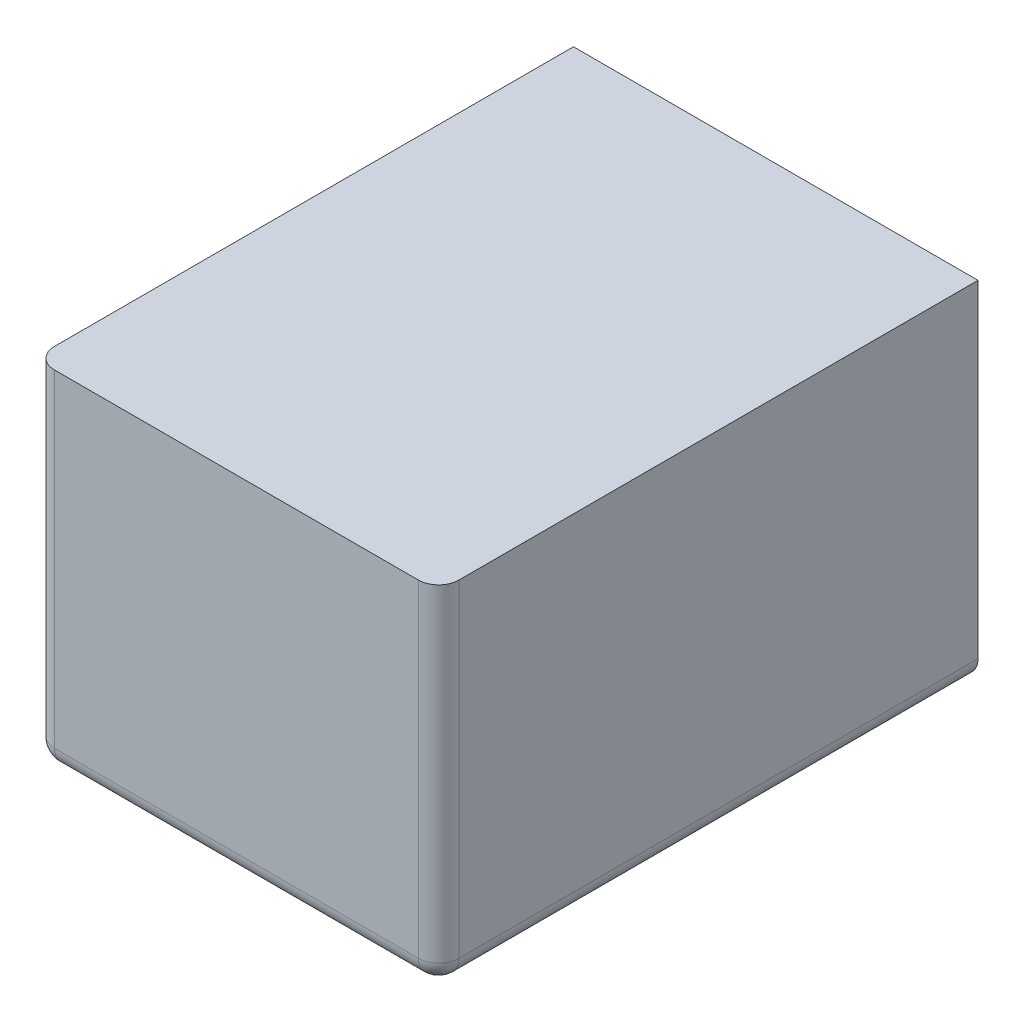
ISO-10303-21;
HEADER;
FILE_DESCRIPTION(('STEP AP214'),'2;1');
FILE_NAME('part.step','',(''),(''),'','','');
FILE_SCHEMA(('AUTOMOTIVE_DESIGN { 1 0 10303 214 1 1 1 1 }'));
ENDSEC;
DATA;
#1=APPLICATION_CONTEXT('core data for automotive mechanical design processes');
#2=APPLICATION_PROTOCOL_DEFINITION('international standard','automotive_design',2000,#1);
#3=PRODUCT_CONTEXT('',#1,'mechanical');
#4=PRODUCT('Part','Part','',(#3));
#5=PRODUCT_RELATED_PRODUCT_CATEGORY('part','',(#4));
#6=PRODUCT_DEFINITION_FORMATION('','',#4);
#7=PRODUCT_DEFINITION_CONTEXT('part definition',#1,'design');
#8=PRODUCT_DEFINITION('design','',#6,#7);
#9=PRODUCT_DEFINITION_SHAPE('','',#8);
#10=(LENGTH_UNIT() NAMED_UNIT(*) SI_UNIT(.MILLI.,.METRE.));
#11=(NAMED_UNIT(*) PLANE_ANGLE_UNIT() SI_UNIT($,.RADIAN.));
#12=(NAMED_UNIT(*) SI_UNIT($,.STERADIAN.) SOLID_ANGLE_UNIT());
#13=UNCERTAINTY_MEASURE_WITH_UNIT(LENGTH_MEASURE(1.E-05),#10,'distance_accuracy_value','');
#14=(GEOMETRIC_REPRESENTATION_CONTEXT(3) GLOBAL_UNCERTAINTY_ASSIGNED_CONTEXT((#13)) GLOBAL_UNIT_ASSIGNED_CONTEXT((#10,
#11,#12)) REPRESENTATION_CONTEXT('',''));
#15=CARTESIAN_POINT('',(0.,0.,0.));
#16=DIRECTION('',(0.,0.,1.));
#17=DIRECTION('',(1.,0.,0.));
#18=AXIS2_PLACEMENT_3D('',#15,#16,#17);
#19=CARTESIAN_POINT('',(380.,1000.,320.));
#20=DIRECTION('',(0.,0.,-1.));
#21=DIRECTION('',(-1.,0.,0.));
#22=AXIS2_PLACEMENT_3D('',#19,#20,#21);
#23=PLANE('',#22);
#24=DIRECTION('',(-1.,0.,0.));
#25=VECTOR('',#24,1.);
#26=CARTESIAN_POINT('',(590.,980.,320.));
#27=LINE('',#26,#25);
#28=CARTESIAN_POINT('',(800.,980.,320.));
#29=VERTEX_POINT('',#28);
#30=CARTESIAN_POINT('',(380.,980.,320.));
#31=VERTEX_POINT('',#30);
#32=EDGE_CURVE('P0_E10',#29,#31,#27,.T.);
#33=ORIENTED_EDGE('',*,*,#32,.F.);
#34=DIRECTION('',(0.,-1.,0.));
#35=VECTOR('',#34,1.);
#36=CARTESIAN_POINT('',(800.,990.,320.));
#37=LINE('',#36,#35);
#38=CARTESIAN_POINT('',(800.,1000.,320.));
#39=VERTEX_POINT('',#38);
#40=EDGE_CURVE('P0_E27',#39,#29,#37,.T.);
#41=ORIENTED_EDGE('',*,*,#40,.F.);
#42=DIRECTION('',(-1.,0.,0.));
#43=VECTOR('',#42,1.);
#44=CARTESIAN_POINT('',(590.,1000.,320.));
#45=LINE('',#44,#43);
#46=CARTESIAN_POINT('',(380.,1000.,320.));
#47=VERTEX_POINT('',#46);
#48=EDGE_CURVE('P0_E76',#39,#47,#45,.T.);
#49=ORIENTED_EDGE('',*,*,#48,.T.);
#50=DIRECTION('',(0.,-1.,0.));
#51=VECTOR('',#50,1.);
#52=CARTESIAN_POINT('',(380.,990.,320.));
#53=LINE('',#52,#51);
#54=EDGE_CURVE('P0_E36',#47,#31,#53,.T.);
#55=ORIENTED_EDGE('',*,*,#54,.T.);
#56=EDGE_LOOP('',(#33,#41,#49,#55));
#57=FACE_BOUND('',#56,.T.);
#58=ADVANCED_FACE('P0_F16',(#57),#23,.F.);
#59=CARTESIAN_POINT('',(380.,1000.,720.));
#60=DIRECTION('',(1.,0.,0.));
#61=DIRECTION('',(0.,0.,-1.));
#62=AXIS2_PLACEMENT_3D('',#59,#60,#61);
#63=PLANE('',#62);
#64=DIRECTION('',(0.,0.,-1.));
#65=VECTOR('',#64,1.);
#66=CARTESIAN_POINT('',(380.,980.,280.));
#67=LINE('',#66,#65);
#68=CARTESIAN_POINT('',(380.,980.,240.));
#69=VERTEX_POINT('',#68);
#70=EDGE_CURVE('P0_E93',#31,#69,#67,.T.);
#71=ORIENTED_EDGE('',*,*,#70,.F.);
#72=ORIENTED_EDGE('',*,*,#54,.F.);
#73=DIRECTION('',(0.,0.,-1.));
#74=VECTOR('',#73,1.);
#75=CARTESIAN_POINT('',(380.,1000.,280.));
#76=LINE('',#75,#74);
#77=CARTESIAN_POINT('',(380.,1000.,240.));
#78=VERTEX_POINT('',#77);
#79=EDGE_CURVE('P0_E66',#47,#78,#76,.T.);
#80=ORIENTED_EDGE('',*,*,#79,.T.);
#81=DIRECTION('',(0.,-1.,0.));
#82=VECTOR('',#81,1.);
#83=CARTESIAN_POINT('',(380.,990.,240.));
#84=LINE('',#83,#82);
#85=EDGE_CURVE('P0_E61',#78,#69,#84,.T.);
#86=ORIENTED_EDGE('',*,*,#85,.T.);
#87=EDGE_LOOP('',(#71,#72,#80,#86));
#88=FACE_BOUND('',#87,.T.);
#89=ADVANCED_FACE('P0_F104',(#88),#63,.F.);
#90=CARTESIAN_POINT('',(800.,1000.,240.));
#91=DIRECTION('',(0.,0.,1.));
#92=DIRECTION('',(1.,0.,0.));
#93=AXIS2_PLACEMENT_3D('',#90,#91,#92);
#94=PLANE('',#93);
#95=DIRECTION('',(1.,0.,0.));
#96=VECTOR('',#95,1.);
#97=CARTESIAN_POINT('',(590.,980.,240.));
#98=LINE('',#97,#96);
#99=CARTESIAN_POINT('',(800.,980.,240.));
#100=VERTEX_POINT('',#99);
#101=EDGE_CURVE('P0_E86',#69,#100,#98,.T.);
#102=ORIENTED_EDGE('',*,*,#101,.F.);
#103=ORIENTED_EDGE('',*,*,#85,.F.);
#104=DIRECTION('',(1.,0.,0.));
#105=VECTOR('',#104,1.);
#106=CARTESIAN_POINT('',(590.,1000.,240.));
#107=LINE('',#106,#105);
#108=CARTESIAN_POINT('',(800.,1000.,240.));
#109=VERTEX_POINT('',#108);
#110=EDGE_CURVE('P0_E59',#78,#109,#107,.T.);
#111=ORIENTED_EDGE('',*,*,#110,.T.);
#112=DIRECTION('',(0.,-1.,0.));
#113=VECTOR('',#112,1.);
#114=CARTESIAN_POINT('',(800.,990.,240.));
#115=LINE('',#114,#113);
#116=EDGE_CURVE('P0_E55',#109,#100,#115,.T.);
#117=ORIENTED_EDGE('',*,*,#116,.T.);
#118=EDGE_LOOP('',(#102,#103,#111,#117));
#119=FACE_BOUND('',#118,.T.);
#120=ADVANCED_FACE('P0_F60',(#119),#94,.F.);
#121=CARTESIAN_POINT('',(800.,1000.,800.));
#122=DIRECTION('',(-1.,0.,0.));
#123=DIRECTION('',(0.,0.,1.));
#124=AXIS2_PLACEMENT_3D('',#121,#122,#123);
#125=PLANE('',#124);
#126=DIRECTION('',(0.,0.,1.));
#127=VECTOR('',#126,1.);
#128=CARTESIAN_POINT('',(800.,980.,280.));
#129=LINE('',#128,#127);
#130=EDGE_CURVE('P0_E74',#100,#29,#129,.T.);
#131=ORIENTED_EDGE('',*,*,#130,.F.);
#132=ORIENTED_EDGE('',*,*,#116,.F.);
#133=DIRECTION('',(0.,0.,1.));
#134=VECTOR('',#133,1.);
#135=CARTESIAN_POINT('',(800.,1000.,280.));
#136=LINE('',#135,#134);
#137=EDGE_CURVE('P0_E20',#109,#39,#136,.T.);
#138=ORIENTED_EDGE('',*,*,#137,.T.);
#139=ORIENTED_EDGE('',*,*,#40,.T.);
#140=EDGE_LOOP('',(#131,#132,#138,#139));
#141=FACE_BOUND('',#140,.T.);
#142=ADVANCED_FACE('P0_F71',(#141),#125,.F.);
#143=CARTESIAN_POINT('',(0.,1000.,0.));
#144=DIRECTION('',(0.,-1.,0.));
#145=DIRECTION('',(0.,0.,-1.));
#146=AXIS2_PLACEMENT_3D('',#143,#144,#145);
#147=PLANE('',#146);
#148=ORIENTED_EDGE('',*,*,#48,.F.);
#149=ORIENTED_EDGE('',*,*,#137,.F.);
#150=ORIENTED_EDGE('',*,*,#110,.F.);
#151=ORIENTED_EDGE('',*,*,#79,.F.);
#152=EDGE_LOOP('',(#148,#149,#150,#151));
#153=FACE_BOUND('',#152,.T.);
#154=ADVANCED_FACE('P0_F78',(#153),#147,.F.);
#155=CARTESIAN_POINT('',(0.,980.,0.));
#156=DIRECTION('',(0.,-1.,0.));
#157=DIRECTION('',(0.,0.,-1.));
#158=AXIS2_PLACEMENT_3D('',#155,#156,#157);
#159=PLANE('',#158);
#160=ORIENTED_EDGE('',*,*,#130,.T.);
#161=ORIENTED_EDGE('',*,*,#32,.T.);
#162=ORIENTED_EDGE('',*,*,#70,.T.);
#163=ORIENTED_EDGE('',*,*,#101,.T.);
#164=EDGE_LOOP('',(#160,#161,#162,#163));
#165=FACE_BOUND('',#164,.T.);
#166=ADVANCED_FACE('P0_F18',(#165),#159,.T.);
#167=CLOSED_SHELL('',(#58,#89,#120,#142,#154,#166));
#168=MANIFOLD_SOLID_BREP('P0_B1',#167);
#169=CARTESIAN_POINT('',(380.,1000.,480.));
#170=DIRECTION('',(0.,0.,-1.));
#171=DIRECTION('',(-1.,0.,0.));
#172=AXIS2_PLACEMENT_3D('',#169,#170,#171);
#173=PLANE('',#172);
#174=DIRECTION('',(-1.,0.,0.));
#175=VECTOR('',#174,1.);
#176=CARTESIAN_POINT('',(590.,980.,480.));
#177=LINE('',#176,#175);
#178=CARTESIAN_POINT('',(800.,980.,480.));
#179=VERTEX_POINT('',#178);
#180=CARTESIAN_POINT('',(380.,980.,480.));
#181=VERTEX_POINT('',#180);
#182=EDGE_CURVE('P1_E11',#179,#181,#177,.T.);
#183=ORIENTED_EDGE('',*,*,#182,.F.);
#184=DIRECTION('',(0.,-1.,0.));
#185=VECTOR('',#184,1.);
#186=CARTESIAN_POINT('',(800.,990.,480.));
#187=LINE('',#186,#185);
#188=CARTESIAN_POINT('',(800.,1000.,480.));
#189=VERTEX_POINT('',#188);
#190=EDGE_CURVE('P1_E28',#189,#179,#187,.T.);
#191=ORIENTED_EDGE('',*,*,#190,.F.);
#192=DIRECTION('',(-1.,0.,0.));
#193=VECTOR('',#192,1.);
#194=CARTESIAN_POINT('',(590.,1000.,480.));
#195=LINE('',#194,#193);
#196=CARTESIAN_POINT('',(380.,1000.,480.));
#197=VERTEX_POINT('',#196);
#198=EDGE_CURVE('P1_E77',#189,#197,#195,.T.);
#199=ORIENTED_EDGE('',*,*,#198,.T.);
#200=DIRECTION('',(0.,-1.,0.));
#201=VECTOR('',#200,1.);
#202=CARTESIAN_POINT('',(380.,990.,480.));
#203=LINE('',#202,#201);
#204=EDGE_CURVE('P1_E37',#197,#181,#203,.T.);
#205=ORIENTED_EDGE('',*,*,#204,.T.);
#206=EDGE_LOOP('',(#183,#191,#199,#205));
#207=FACE_BOUND('',#206,.T.);
#208=ADVANCED_FACE('P1_F17',(#207),#173,.F.);
#209=CARTESIAN_POINT('',(380.,1000.,720.));
#210=DIRECTION('',(1.,0.,0.));
#211=DIRECTION('',(0.,0.,-1.));
#212=AXIS2_PLACEMENT_3D('',#209,#210,#211);
#213=PLANE('',#212);
#214=DIRECTION('',(0.,0.,-1.));
#215=VECTOR('',#214,1.);
#216=CARTESIAN_POINT('',(380.,980.,440.));
#217=LINE('',#216,#215);
#218=CARTESIAN_POINT('',(380.,980.,400.));
#219=VERTEX_POINT('',#218);
#220=EDGE_CURVE('P1_E94',#181,#219,#217,.T.);
#221=ORIENTED_EDGE('',*,*,#220,.F.);
#222=ORIENTED_EDGE('',*,*,#204,.F.);
#223=DIRECTION('',(0.,0.,-1.));
#224=VECTOR('',#223,1.);
#225=CARTESIAN_POINT('',(380.,1000.,440.));
#226=LINE('',#225,#224);
#227=CARTESIAN_POINT('',(380.,1000.,400.));
#228=VERTEX_POINT('',#227);
#229=EDGE_CURVE('P1_E67',#197,#228,#226,.T.);
#230=ORIENTED_EDGE('',*,*,#229,.T.);
#231=DIRECTION('',(0.,-1.,0.));
#232=VECTOR('',#231,1.);
#233=CARTESIAN_POINT('',(380.,990.,400.));
#234=LINE('',#233,#232);
#235=EDGE_CURVE('P1_E62',#228,#219,#234,.T.);
#236=ORIENTED_EDGE('',*,*,#235,.T.);
#237=EDGE_LOOP('',(#221,#222,#230,#236));
#238=FACE_BOUND('',#237,.T.);
#239=ADVANCED_FACE('P1_F105',(#238),#213,.F.);
#240=CARTESIAN_POINT('',(800.,1000.,400.));
#241=DIRECTION('',(0.,0.,1.));
#242=DIRECTION('',(1.,0.,0.));
#243=AXIS2_PLACEMENT_3D('',#240,#241,#242);
#244=PLANE('',#243);
#245=DIRECTION('',(1.,0.,0.));
#246=VECTOR('',#245,1.);
#247=CARTESIAN_POINT('',(590.,980.,400.));
#248=LINE('',#247,#246);
#249=CARTESIAN_POINT('',(800.,980.,400.));
#250=VERTEX_POINT('',#249);
#251=EDGE_CURVE('P1_E87',#219,#250,#248,.T.);
#252=ORIENTED_EDGE('',*,*,#251,.F.);
#253=ORIENTED_EDGE('',*,*,#235,.F.);
#254=DIRECTION('',(1.,0.,0.));
#255=VECTOR('',#254,1.);
#256=CARTESIAN_POINT('',(590.,1000.,400.));
#257=LINE('',#256,#255);
#258=CARTESIAN_POINT('',(800.,1000.,400.));
#259=VERTEX_POINT('',#258);
#260=EDGE_CURVE('P1_E60',#228,#259,#257,.T.);
#261=ORIENTED_EDGE('',*,*,#260,.T.);
#262=DIRECTION('',(0.,-1.,0.));
#263=VECTOR('',#262,1.);
#264=CARTESIAN_POINT('',(800.,990.,400.));
#265=LINE('',#264,#263);
#266=EDGE_CURVE('P1_E56',#259,#250,#265,.T.);
#267=ORIENTED_EDGE('',*,*,#266,.T.);
#268=EDGE_LOOP('',(#252,#253,#261,#267));
#269=FACE_BOUND('',#268,.T.);
#270=ADVANCED_FACE('P1_F61',(#269),#244,.F.);
#271=CARTESIAN_POINT('',(800.,1000.,800.));
#272=DIRECTION('',(-1.,0.,0.));
#273=DIRECTION('',(0.,0.,1.));
#274=AXIS2_PLACEMENT_3D('',#271,#272,#273);
#275=PLANE('',#274);
#276=DIRECTION('',(0.,0.,1.));
#277=VECTOR('',#276,1.);
#278=CARTESIAN_POINT('',(800.,980.,440.));
#279=LINE('',#278,#277);
#280=EDGE_CURVE('P1_E75',#250,#179,#279,.T.);
#281=ORIENTED_EDGE('',*,*,#280,.F.);
#282=ORIENTED_EDGE('',*,*,#266,.F.);
#283=DIRECTION('',(0.,0.,1.));
#284=VECTOR('',#283,1.);
#285=CARTESIAN_POINT('',(800.,1000.,440.));
#286=LINE('',#285,#284);
#287=EDGE_CURVE('P1_E21',#259,#189,#286,.T.);
#288=ORIENTED_EDGE('',*,*,#287,.T.);
#289=ORIENTED_EDGE('',*,*,#190,.T.);
#290=EDGE_LOOP('',(#281,#282,#288,#289));
#291=FACE_BOUND('',#290,.T.);
#292=ADVANCED_FACE('P1_F72',(#291),#275,.F.);
#293=CARTESIAN_POINT('',(0.,1000.,0.));
#294=DIRECTION('',(0.,-1.,0.));
#295=DIRECTION('',(0.,0.,-1.));
#296=AXIS2_PLACEMENT_3D('',#293,#294,#295);
#297=PLANE('',#296);
#298=ORIENTED_EDGE('',*,*,#198,.F.);
#299=ORIENTED_EDGE('',*,*,#287,.F.);
#300=ORIENTED_EDGE('',*,*,#260,.F.);
#301=ORIENTED_EDGE('',*,*,#229,.F.);
#302=EDGE_LOOP('',(#298,#299,#300,#301));
#303=FACE_BOUND('',#302,.T.);
#304=ADVANCED_FACE('P1_F79',(#303),#297,.F.);
#305=CARTESIAN_POINT('',(0.,980.,0.));
#306=DIRECTION('',(0.,-1.,0.));
#307=DIRECTION('',(0.,0.,-1.));
#308=AXIS2_PLACEMENT_3D('',#305,#306,#307);
#309=PLANE('',#308);
#310=ORIENTED_EDGE('',*,*,#280,.T.);
#311=ORIENTED_EDGE('',*,*,#182,.T.);
#312=ORIENTED_EDGE('',*,*,#220,.T.);
#313=ORIENTED_EDGE('',*,*,#251,.T.);
#314=EDGE_LOOP('',(#310,#311,#312,#313));
#315=FACE_BOUND('',#314,.T.);
#316=ADVANCED_FACE('P1_F19',(#315),#309,.T.);
#317=CLOSED_SHELL('',(#208,#239,#270,#292,#304,#316));
#318=MANIFOLD_SOLID_BREP('P1_B1',#317);
#319=CARTESIAN_POINT('',(380.,1000.,640.));
#320=DIRECTION('',(0.,0.,-1.));
#321=DIRECTION('',(-1.,0.,0.));
#322=AXIS2_PLACEMENT_3D('',#319,#320,#321);
#323=PLANE('',#322);
#324=DIRECTION('',(-1.,0.,0.));
#325=VECTOR('',#324,1.);
#326=CARTESIAN_POINT('',(590.,980.,640.));
#327=LINE('',#326,#325);
#328=CARTESIAN_POINT('',(800.,980.,640.));
#329=VERTEX_POINT('',#328);
#330=CARTESIAN_POINT('',(380.,980.,640.));
#331=VERTEX_POINT('',#330);
#332=EDGE_CURVE('P2_E11',#329,#331,#327,.T.);
#333=ORIENTED_EDGE('',*,*,#332,.F.);
#334=DIRECTION('',(0.,-1.,0.));
#335=VECTOR('',#334,1.);
#336=CARTESIAN_POINT('',(800.,990.,640.));
#337=LINE('',#336,#335);
#338=CARTESIAN_POINT('',(800.,1000.,640.));
#339=VERTEX_POINT('',#338);
#340=EDGE_CURVE('P2_E28',#339,#329,#337,.T.);
#341=ORIENTED_EDGE('',*,*,#340,.F.);
#342=DIRECTION('',(-1.,0.,0.));
#343=VECTOR('',#342,1.);
#344=CARTESIAN_POINT('',(590.,1000.,640.));
#345=LINE('',#344,#343);
#346=CARTESIAN_POINT('',(380.,1000.,640.));
#347=VERTEX_POINT('',#346);
#348=EDGE_CURVE('P2_E77',#339,#347,#345,.T.);
#349=ORIENTED_EDGE('',*,*,#348,.T.);
#350=DIRECTION('',(0.,-1.,0.));
#351=VECTOR('',#350,1.);
#352=CARTESIAN_POINT('',(380.,990.,640.));
#353=LINE('',#352,#351);
#354=EDGE_CURVE('P2_E37',#347,#331,#353,.T.);
#355=ORIENTED_EDGE('',*,*,#354,.T.);
#356=EDGE_LOOP('',(#333,#341,#349,#355));
#357=FACE_BOUND('',#356,.T.);
#358=ADVANCED_FACE('P2_F17',(#357),#323,.F.);
#359=CARTESIAN_POINT('',(380.,1000.,720.));
#360=DIRECTION('',(1.,0.,0.));
#361=DIRECTION('',(0.,0.,-1.));
#362=AXIS2_PLACEMENT_3D('',#359,#360,#361);
#363=PLANE('',#362);
#364=DIRECTION('',(0.,0.,-1.));
#365=VECTOR('',#364,1.);
#366=CARTESIAN_POINT('',(380.,980.,600.));
#367=LINE('',#366,#365);
#368=CARTESIAN_POINT('',(380.,980.,560.));
#369=VERTEX_POINT('',#368);
#370=EDGE_CURVE('P2_E94',#331,#369,#367,.T.);
#371=ORIENTED_EDGE('',*,*,#370,.F.);
#372=ORIENTED_EDGE('',*,*,#354,.F.);
#373=DIRECTION('',(0.,0.,-1.));
#374=VECTOR('',#373,1.);
#375=CARTESIAN_POINT('',(380.,1000.,600.));
#376=LINE('',#375,#374);
#377=CARTESIAN_POINT('',(380.,1000.,560.));
#378=VERTEX_POINT('',#377);
#379=EDGE_CURVE('P2_E67',#347,#378,#376,.T.);
#380=ORIENTED_EDGE('',*,*,#379,.T.);
#381=DIRECTION('',(0.,-1.,0.));
#382=VECTOR('',#381,1.);
#383=CARTESIAN_POINT('',(380.,990.,560.));
#384=LINE('',#383,#382);
#385=EDGE_CURVE('P2_E62',#378,#369,#384,.T.);
#386=ORIENTED_EDGE('',*,*,#385,.T.);
#387=EDGE_LOOP('',(#371,#372,#380,#386));
#388=FACE_BOUND('',#387,.T.);
#389=ADVANCED_FACE('P2_F105',(#388),#363,.F.);
#390=CARTESIAN_POINT('',(800.,1000.,560.));
#391=DIRECTION('',(0.,0.,1.));
#392=DIRECTION('',(1.,0.,0.));
#393=AXIS2_PLACEMENT_3D('',#390,#391,#392);
#394=PLANE('',#393);
#395=DIRECTION('',(1.,0.,0.));
#396=VECTOR('',#395,1.);
#397=CARTESIAN_POINT('',(590.,980.,560.));
#398=LINE('',#397,#396);
#399=CARTESIAN_POINT('',(800.,980.,560.));
#400=VERTEX_POINT('',#399);
#401=EDGE_CURVE('P2_E87',#369,#400,#398,.T.);
#402=ORIENTED_EDGE('',*,*,#401,.F.);
#403=ORIENTED_EDGE('',*,*,#385,.F.);
#404=DIRECTION('',(1.,0.,0.));
#405=VECTOR('',#404,1.);
#406=CARTESIAN_POINT('',(590.,1000.,560.));
#407=LINE('',#406,#405);
#408=CARTESIAN_POINT('',(800.,1000.,560.));
#409=VERTEX_POINT('',#408);
#410=EDGE_CURVE('P2_E60',#378,#409,#407,.T.);
#411=ORIENTED_EDGE('',*,*,#410,.T.);
#412=DIRECTION('',(0.,-1.,0.));
#413=VECTOR('',#412,1.);
#414=CARTESIAN_POINT('',(800.,990.,560.));
#415=LINE('',#414,#413);
#416=EDGE_CURVE('P2_E56',#409,#400,#415,.T.);
#417=ORIENTED_EDGE('',*,*,#416,.T.);
#418=EDGE_LOOP('',(#402,#403,#411,#417));
#419=FACE_BOUND('',#418,.T.);
#420=ADVANCED_FACE('P2_F61',(#419),#394,.F.);
#421=CARTESIAN_POINT('',(800.,1000.,800.));
#422=DIRECTION('',(-1.,0.,0.));
#423=DIRECTION('',(0.,0.,1.));
#424=AXIS2_PLACEMENT_3D('',#421,#422,#423);
#425=PLANE('',#424);
#426=DIRECTION('',(0.,0.,1.));
#427=VECTOR('',#426,1.);
#428=CARTESIAN_POINT('',(800.,980.,600.));
#429=LINE('',#428,#427);
#430=EDGE_CURVE('P2_E75',#400,#329,#429,.T.);
#431=ORIENTED_EDGE('',*,*,#430,.F.);
#432=ORIENTED_EDGE('',*,*,#416,.F.);
#433=DIRECTION('',(0.,0.,1.));
#434=VECTOR('',#433,1.);
#435=CARTESIAN_POINT('',(800.,1000.,600.));
#436=LINE('',#435,#434);
#437=EDGE_CURVE('P2_E21',#409,#339,#436,.T.);
#438=ORIENTED_EDGE('',*,*,#437,.T.);
#439=ORIENTED_EDGE('',*,*,#340,.T.);
#440=EDGE_LOOP('',(#431,#432,#438,#439));
#441=FACE_BOUND('',#440,.T.);
#442=ADVANCED_FACE('P2_F72',(#441),#425,.F.);
#443=CARTESIAN_POINT('',(0.,1000.,0.));
#444=DIRECTION('',(0.,-1.,0.));
#445=DIRECTION('',(0.,0.,-1.));
#446=AXIS2_PLACEMENT_3D('',#443,#444,#445);
#447=PLANE('',#446);
#448=ORIENTED_EDGE('',*,*,#348,.F.);
#449=ORIENTED_EDGE('',*,*,#437,.F.);
#450=ORIENTED_EDGE('',*,*,#410,.F.);
#451=ORIENTED_EDGE('',*,*,#379,.F.);
#452=EDGE_LOOP('',(#448,#449,#450,#451));
#453=FACE_BOUND('',#452,.T.);
#454=ADVANCED_FACE('P2_F79',(#453),#447,.F.);
#455=CARTESIAN_POINT('',(0.,980.,0.));
#456=DIRECTION('',(0.,-1.,0.));
#457=DIRECTION('',(0.,0.,-1.));
#458=AXIS2_PLACEMENT_3D('',#455,#456,#457);
#459=PLANE('',#458);
#460=ORIENTED_EDGE('',*,*,#430,.T.);
#461=ORIENTED_EDGE('',*,*,#332,.T.);
#462=ORIENTED_EDGE('',*,*,#370,.T.);
#463=ORIENTED_EDGE('',*,*,#401,.T.);
#464=EDGE_LOOP('',(#460,#461,#462,#463));
#465=FACE_BOUND('',#464,.T.);
#466=ADVANCED_FACE('P2_F19',(#465),#459,.T.);
#467=CLOSED_SHELL('',(#358,#389,#420,#442,#454,#466));
#468=MANIFOLD_SOLID_BREP('P2_B1',#467);
#469=CARTESIAN_POINT('',(380.,1000.,800.));
#470=DIRECTION('',(0.,0.,-1.));
#471=DIRECTION('',(-1.,0.,0.));
#472=AXIS2_PLACEMENT_3D('',#469,#470,#471);
#473=PLANE('',#472);
#474=DIRECTION('',(-1.,0.,0.));
#475=VECTOR('',#474,1.);
#476=CARTESIAN_POINT('',(590.,980.,800.));
#477=LINE('',#476,#475);
#478=CARTESIAN_POINT('',(800.,980.,800.));
#479=VERTEX_POINT('',#478);
#480=CARTESIAN_POINT('',(380.,980.,800.));
#481=VERTEX_POINT('',#480);
#482=EDGE_CURVE('P3_E11',#479,#481,#477,.T.);
#483=ORIENTED_EDGE('',*,*,#482,.F.);
#484=DIRECTION('',(0.,-1.,0.));
#485=VECTOR('',#484,1.);
#486=CARTESIAN_POINT('',(800.,990.,800.));
#487=LINE('',#486,#485);
#488=CARTESIAN_POINT('',(800.,1000.,800.));
#489=VERTEX_POINT('',#488);
#490=EDGE_CURVE('P3_E28',#489,#479,#487,.T.);
#491=ORIENTED_EDGE('',*,*,#490,.F.);
#492=DIRECTION('',(-1.,0.,0.));
#493=VECTOR('',#492,1.);
#494=CARTESIAN_POINT('',(590.,1000.,800.));
#495=LINE('',#494,#493);
#496=CARTESIAN_POINT('',(380.,1000.,800.));
#497=VERTEX_POINT('',#496);
#498=EDGE_CURVE('P3_E77',#489,#497,#495,.T.);
#499=ORIENTED_EDGE('',*,*,#498,.T.);
#500=DIRECTION('',(0.,-1.,0.));
#501=VECTOR('',#500,1.);
#502=CARTESIAN_POINT('',(380.,990.,800.));
#503=LINE('',#502,#501);
#504=EDGE_CURVE('P3_E37',#497,#481,#503,.T.);
#505=ORIENTED_EDGE('',*,*,#504,.T.);
#506=EDGE_LOOP('',(#483,#491,#499,#505));
#507=FACE_BOUND('',#506,.T.);
#508=ADVANCED_FACE('P3_F17',(#507),#473,.F.);
#509=CARTESIAN_POINT('',(380.,1000.,720.));
#510=DIRECTION('',(1.,0.,0.));
#511=DIRECTION('',(0.,0.,-1.));
#512=AXIS2_PLACEMENT_3D('',#509,#510,#511);
#513=PLANE('',#512);
#514=DIRECTION('',(0.,0.,-1.));
#515=VECTOR('',#514,1.);
#516=CARTESIAN_POINT('',(380.,980.,760.));
#517=LINE('',#516,#515);
#518=CARTESIAN_POINT('',(380.,980.,720.));
#519=VERTEX_POINT('',#518);
#520=EDGE_CURVE('P3_E94',#481,#519,#517,.T.);
#521=ORIENTED_EDGE('',*,*,#520,.F.);
#522=ORIENTED_EDGE('',*,*,#504,.F.);
#523=DIRECTION('',(0.,0.,-1.));
#524=VECTOR('',#523,1.);
#525=CARTESIAN_POINT('',(380.,1000.,760.));
#526=LINE('',#525,#524);
#527=CARTESIAN_POINT('',(380.,1000.,720.));
#528=VERTEX_POINT('',#527);
#529=EDGE_CURVE('P3_E67',#497,#528,#526,.T.);
#530=ORIENTED_EDGE('',*,*,#529,.T.);
#531=DIRECTION('',(0.,-1.,0.));
#532=VECTOR('',#531,1.);
#533=CARTESIAN_POINT('',(380.,990.,720.));
#534=LINE('',#533,#532);
#535=EDGE_CURVE('P3_E62',#528,#519,#534,.T.);
#536=ORIENTED_EDGE('',*,*,#535,.T.);
#537=EDGE_LOOP('',(#521,#522,#530,#536));
#538=FACE_BOUND('',#537,.T.);
#539=ADVANCED_FACE('P3_F105',(#538),#513,.F.);
#540=CARTESIAN_POINT('',(800.,1000.,720.));
#541=DIRECTION('',(0.,0.,1.));
#542=DIRECTION('',(1.,0.,0.));
#543=AXIS2_PLACEMENT_3D('',#540,#541,#542);
#544=PLANE('',#543);
#545=DIRECTION('',(1.,0.,0.));
#546=VECTOR('',#545,1.);
#547=CARTESIAN_POINT('',(590.,980.,720.));
#548=LINE('',#547,#546);
#549=CARTESIAN_POINT('',(800.,980.,720.));
#550=VERTEX_POINT('',#549);
#551=EDGE_CURVE('P3_E87',#519,#550,#548,.T.);
#552=ORIENTED_EDGE('',*,*,#551,.F.);
#553=ORIENTED_EDGE('',*,*,#535,.F.);
#554=DIRECTION('',(1.,0.,0.));
#555=VECTOR('',#554,1.);
#556=CARTESIAN_POINT('',(590.,1000.,720.));
#557=LINE('',#556,#555);
#558=CARTESIAN_POINT('',(800.,1000.,720.));
#559=VERTEX_POINT('',#558);
#560=EDGE_CURVE('P3_E60',#528,#559,#557,.T.);
#561=ORIENTED_EDGE('',*,*,#560,.T.);
#562=DIRECTION('',(0.,-1.,0.));
#563=VECTOR('',#562,1.);
#564=CARTESIAN_POINT('',(800.,990.,720.));
#565=LINE('',#564,#563);
#566=EDGE_CURVE('P3_E56',#559,#550,#565,.T.);
#567=ORIENTED_EDGE('',*,*,#566,.T.);
#568=EDGE_LOOP('',(#552,#553,#561,#567));
#569=FACE_BOUND('',#568,.T.);
#570=ADVANCED_FACE('P3_F61',(#569),#544,.F.);
#571=CARTESIAN_POINT('',(800.,1000.,800.));
#572=DIRECTION('',(-1.,0.,0.));
#573=DIRECTION('',(0.,0.,1.));
#574=AXIS2_PLACEMENT_3D('',#571,#572,#573);
#575=PLANE('',#574);
#576=DIRECTION('',(0.,0.,1.));
#577=VECTOR('',#576,1.);
#578=CARTESIAN_POINT('',(800.,980.,760.));
#579=LINE('',#578,#577);
#580=EDGE_CURVE('P3_E75',#550,#479,#579,.T.);
#581=ORIENTED_EDGE('',*,*,#580,.F.);
#582=ORIENTED_EDGE('',*,*,#566,.F.);
#583=DIRECTION('',(0.,0.,1.));
#584=VECTOR('',#583,1.);
#585=CARTESIAN_POINT('',(800.,1000.,760.));
#586=LINE('',#585,#584);
#587=EDGE_CURVE('P3_E21',#559,#489,#586,.T.);
#588=ORIENTED_EDGE('',*,*,#587,.T.);
#589=ORIENTED_EDGE('',*,*,#490,.T.);
#590=EDGE_LOOP('',(#581,#582,#588,#589));
#591=FACE_BOUND('',#590,.T.);
#592=ADVANCED_FACE('P3_F72',(#591),#575,.F.);
#593=CARTESIAN_POINT('',(0.,1000.,0.));
#594=DIRECTION('',(0.,-1.,0.));
#595=DIRECTION('',(0.,0.,-1.));
#596=AXIS2_PLACEMENT_3D('',#593,#594,#595);
#597=PLANE('',#596);
#598=ORIENTED_EDGE('',*,*,#498,.F.);
#599=ORIENTED_EDGE('',*,*,#587,.F.);
#600=ORIENTED_EDGE('',*,*,#560,.F.);
#601=ORIENTED_EDGE('',*,*,#529,.F.);
#602=EDGE_LOOP('',(#598,#599,#600,#601));
#603=FACE_BOUND('',#602,.T.);
#604=ADVANCED_FACE('P3_F79',(#603),#597,.F.);
#605=CARTESIAN_POINT('',(0.,980.,0.));
#606=DIRECTION('',(0.,-1.,0.));
#607=DIRECTION('',(0.,0.,-1.));
#608=AXIS2_PLACEMENT_3D('',#605,#606,#607);
#609=PLANE('',#608);
#610=ORIENTED_EDGE('',*,*,#580,.T.);
#611=ORIENTED_EDGE('',*,*,#482,.T.);
#612=ORIENTED_EDGE('',*,*,#520,.T.);
#613=ORIENTED_EDGE('',*,*,#551,.T.);
#614=EDGE_LOOP('',(#610,#611,#612,#613));
#615=FACE_BOUND('',#614,.T.);
#616=ADVANCED_FACE('P3_F19',(#615),#609,.T.);
#617=CLOSED_SHELL('',(#508,#539,#570,#592,#604,#616));
#618=MANIFOLD_SOLID_BREP('P3_B1',#617);
#619=CARTESIAN_POINT('',(300.,0.,100.));
#620=DIRECTION('',(0.,0.,1.));
#621=DIRECTION('',(1.,0.,0.));
#622=AXIS2_PLACEMENT_3D('',#619,#620,#621);
#623=PLANE('',#622);
#624=DIRECTION('',(-1.,0.,0.));
#625=VECTOR('',#624,1.);
#626=CARTESIAN_POINT('',(600.,1000.,100.));
#627=LINE('',#626,#625);
#628=CARTESIAN_POINT('',(870.,1000.,100.));
#629=VERTEX_POINT('',#628);
#630=CARTESIAN_POINT('',(330.,1000.,100.));
#631=VERTEX_POINT('',#630);
#632=EDGE_CURVE('P4_E37',#629,#631,#627,.T.);
#633=ORIENTED_EDGE('',*,*,#632,.T.);
#634=CARTESIAN_POINT('',(330.,1030.,100.));
#635=DIRECTION('',(0.,0.,1.));
#636=DIRECTION('',(1.,0.,0.));
#637=AXIS2_PLACEMENT_3D('',#634,#635,#636);
#638=CIRCLE('',#637,30.);
#639=CARTESIAN_POINT('',(300.,1030.,100.));
#640=VERTEX_POINT('',#639);
#641=EDGE_CURVE('P4_E109',#640,#631,#638,.T.);
#642=ORIENTED_EDGE('',*,*,#641,.F.);
#643=DIRECTION('',(0.,1.,0.));
#644=VECTOR('',#643,1.);
#645=CARTESIAN_POINT('',(300.,1273.,100.));
#646=LINE('',#645,#644);
#647=CARTESIAN_POINT('',(300.,1516.,100.));
#648=VERTEX_POINT('',#647);
#649=EDGE_CURVE('P4_E155',#640,#648,#646,.T.);
#650=ORIENTED_EDGE('',*,*,#649,.T.);
#651=DIRECTION('',(-1.,0.,0.));
#652=VECTOR('',#651,1.);
#653=CARTESIAN_POINT('',(600.,1516.,100.));
#654=LINE('',#653,#652);
#655=CARTESIAN_POINT('',(900.,1516.,100.000000000004));
#656=VERTEX_POINT('',#655);
#657=EDGE_CURVE('P4_E176',#656,#648,#654,.T.);
#658=ORIENTED_EDGE('',*,*,#657,.F.);
#659=DIRECTION('',(0.,1.,0.));
#660=VECTOR('',#659,1.);
#661=CARTESIAN_POINT('',(900.,1273.,100.));
#662=LINE('',#661,#660);
#663=CARTESIAN_POINT('',(900.,1030.,100.000000000004));
#664=VERTEX_POINT('',#663);
#665=EDGE_CURVE('P4_E28',#664,#656,#662,.T.);
#666=ORIENTED_EDGE('',*,*,#665,.F.);
#667=CARTESIAN_POINT('',(870.,1030.,100.));
#668=DIRECTION('',(0.,0.,1.));
#669=DIRECTION('',(1.,0.,0.));
#670=AXIS2_PLACEMENT_3D('',#667,#668,#669);
#671=CIRCLE('',#670,30.);
#672=EDGE_CURVE('P4_E11',#629,#664,#671,.T.);
#673=ORIENTED_EDGE('',*,*,#672,.F.);
#674=EDGE_LOOP('',(#633,#642,#650,#658,#666,#673));
#675=FACE_BOUND('',#674,.T.);
#676=ADVANCED_FACE('P4_F17',(#675),#623,.F.);
#677=CARTESIAN_POINT('',(0.,1516.,0.));
#678=DIRECTION('',(0.,1.,0.));
#679=DIRECTION('',(0.,0.,1.));
#680=AXIS2_PLACEMENT_3D('',#677,#678,#679);
#681=PLANE('',#680);
#682=DIRECTION('',(0.,0.,1.));
#683=VECTOR('',#682,1.);
#684=CARTESIAN_POINT('',(300.,1516.,485.));
#685=LINE('',#684,#683);
#686=CARTESIAN_POINT('',(300.,1516.,870.));
#687=VERTEX_POINT('',#686);
#688=EDGE_CURVE('P4_E165',#648,#687,#685,.T.);
#689=ORIENTED_EDGE('',*,*,#688,.T.);
#690=CARTESIAN_POINT('',(330.,1516.,870.));
#691=DIRECTION('',(0.,-1.,0.));
#692=DIRECTION('',(0.,0.,1.));
#693=AXIS2_PLACEMENT_3D('',#690,#691,#692);
#694=CIRCLE('',#693,30.);
#695=CARTESIAN_POINT('',(330.,1516.,900.));
#696=VERTEX_POINT('',#695);
#697=EDGE_CURVE('P4_E158',#696,#687,#694,.T.);
#698=ORIENTED_EDGE('',*,*,#697,.F.);
#699=DIRECTION('',(1.,0.,0.));
#700=VECTOR('',#699,1.);
#701=CARTESIAN_POINT('',(600.,1516.,900.));
#702=LINE('',#701,#700);
#703=CARTESIAN_POINT('',(870.,1516.,900.));
#704=VERTEX_POINT('',#703);
#705=EDGE_CURVE('P4_E139',#696,#704,#702,.T.);
#706=ORIENTED_EDGE('',*,*,#705,.T.);
#707=CARTESIAN_POINT('',(870.,1516.,870.));
#708=DIRECTION('',(0.,-1.,0.));
#709=DIRECTION('',(0.,0.,1.));
#710=AXIS2_PLACEMENT_3D('',#707,#708,#709);
#711=CIRCLE('',#710,30.);
#712=CARTESIAN_POINT('',(900.,1516.,870.));
#713=VERTEX_POINT('',#712);
#714=EDGE_CURVE('P4_E162',#713,#704,#711,.T.);
#715=ORIENTED_EDGE('',*,*,#714,.F.);
#716=DIRECTION('',(0.,0.,-1.));
#717=VECTOR('',#716,1.);
#718=CARTESIAN_POINT('',(900.,1516.,485.000000000002));
#719=LINE('',#718,#717);
#720=EDGE_CURVE('P4_E154',#713,#656,#719,.T.);
#721=ORIENTED_EDGE('',*,*,#720,.T.);
#722=ORIENTED_EDGE('',*,*,#657,.T.);
#723=EDGE_LOOP('',(#689,#698,#706,#715,#721,#722));
#724=FACE_BOUND('',#723,.T.);
#725=ADVANCED_FACE('P4_F201',(#724),#681,.T.);
#726=CARTESIAN_POINT('',(900.,0.,900.000000000004));
#727=DIRECTION('',(1.,0.,0.));
#728=DIRECTION('',(0.,0.,-1.));
#729=AXIS2_PLACEMENT_3D('',#726,#727,#728);
#730=PLANE('',#729);
#731=DIRECTION('',(0.,-1.,0.));
#732=VECTOR('',#731,1.);
#733=CARTESIAN_POINT('',(900.,1273.,870.));
#734=LINE('',#733,#732);
#735=CARTESIAN_POINT('',(900.,1030.,870.));
#736=VERTEX_POINT('',#735);
#737=EDGE_CURVE('P4_E125',#713,#736,#734,.T.);
#738=ORIENTED_EDGE('',*,*,#737,.T.);
#739=DIRECTION('',(0.,0.,-1.));
#740=VECTOR('',#739,1.);
#741=CARTESIAN_POINT('',(900.,1030.,485.000000000002));
#742=LINE('',#741,#740);
#743=EDGE_CURVE('P4_E150',#736,#664,#742,.T.);
#744=ORIENTED_EDGE('',*,*,#743,.T.);
#745=ORIENTED_EDGE('',*,*,#665,.T.);
#746=ORIENTED_EDGE('',*,*,#720,.F.);
#747=EDGE_LOOP('',(#738,#744,#745,#746));
#748=FACE_BOUND('',#747,.T.);
#749=ADVANCED_FACE('P4_F211',(#748),#730,.T.);
#750=CARTESIAN_POINT('',(870.,1030.,500.000000000005));
#751=DIRECTION('',(0.,0.,-1.));
#752=DIRECTION('',(-1.,0.,0.));
#753=AXIS2_PLACEMENT_3D('',#750,#751,#752);
#754=CYLINDRICAL_SURFACE('',#753,30.);
#755=CARTESIAN_POINT('',(870.,1030.,870.));
#756=DIRECTION('',(0.,0.,-1.));
#757=DIRECTION('',(-1.,0.,0.));
#758=AXIS2_PLACEMENT_3D('',#755,#756,#757);
#759=CIRCLE('',#758,30.);
#760=CARTESIAN_POINT('',(870.,1000.,870.));
#761=VERTEX_POINT('',#760);
#762=EDGE_CURVE('P4_E127',#736,#761,#759,.T.);
#763=ORIENTED_EDGE('',*,*,#762,.T.);
#764=DIRECTION('',(0.,0.,-1.));
#765=VECTOR('',#764,1.);
#766=CARTESIAN_POINT('',(870.,1000.,500.000000000005));
#767=LINE('',#766,#765);
#768=EDGE_CURVE('P4_E99',#761,#629,#767,.T.);
#769=ORIENTED_EDGE('',*,*,#768,.T.);
#770=ORIENTED_EDGE('',*,*,#672,.T.);
#771=ORIENTED_EDGE('',*,*,#743,.F.);
#772=EDGE_LOOP('',(#763,#769,#770,#771));
#773=FACE_BOUND('',#772,.T.);
#774=ADVANCED_FACE('P4_F189',(#773),#754,.T.);
#775=CARTESIAN_POINT('',(300.,0.,100.));
#776=DIRECTION('',(-1.,0.,0.));
#777=DIRECTION('',(0.,0.,1.));
#778=AXIS2_PLACEMENT_3D('',#775,#776,#777);
#779=PLANE('',#778);
#780=DIRECTION('',(0.,1.,0.));
#781=VECTOR('',#780,1.);
#782=CARTESIAN_POINT('',(300.,1273.,870.));
#783=LINE('',#782,#781);
#784=CARTESIAN_POINT('',(300.,1030.,870.));
#785=VERTEX_POINT('',#784);
#786=EDGE_CURVE('P4_E142',#785,#687,#783,.T.);
#787=ORIENTED_EDGE('',*,*,#786,.T.);
#788=ORIENTED_EDGE('',*,*,#688,.F.);
#789=ORIENTED_EDGE('',*,*,#649,.F.);
#790=DIRECTION('',(0.,0.,1.));
#791=VECTOR('',#790,1.);
#792=CARTESIAN_POINT('',(300.,1030.,485.));
#793=LINE('',#792,#791);
#794=EDGE_CURVE('P4_E111',#640,#785,#793,.T.);
#795=ORIENTED_EDGE('',*,*,#794,.T.);
#796=EDGE_LOOP('',(#787,#788,#789,#795));
#797=FACE_BOUND('',#796,.T.);
#798=ADVANCED_FACE('P4_F209',(#797),#779,.T.);
#799=CARTESIAN_POINT('',(900.,0.,900.));
#800=DIRECTION('',(0.,0.,-1.));
#801=DIRECTION('',(-1.,0.,0.));
#802=AXIS2_PLACEMENT_3D('',#799,#800,#801);
#803=PLANE('',#802);
#804=ORIENTED_EDGE('',*,*,#705,.F.);
#805=DIRECTION('',(0.,1.,0.));
#806=VECTOR('',#805,1.);
#807=CARTESIAN_POINT('',(330.,1273.,900.));
#808=LINE('',#807,#806);
#809=CARTESIAN_POINT('',(330.,1030.,900.));
#810=VERTEX_POINT('',#809);
#811=EDGE_CURVE('P4_E129',#810,#696,#808,.T.);
#812=ORIENTED_EDGE('',*,*,#811,.F.);
#813=DIRECTION('',(-1.,0.,0.));
#814=VECTOR('',#813,1.);
#815=CARTESIAN_POINT('',(600.,1030.,900.));
#816=LINE('',#815,#814);
#817=CARTESIAN_POINT('',(870.000000000001,1030.,900.));
#818=VERTEX_POINT('',#817);
#819=EDGE_CURVE('P4_E116',#818,#810,#816,.T.);
#820=ORIENTED_EDGE('',*,*,#819,.F.);
#821=DIRECTION('',(0.,-1.,0.));
#822=VECTOR('',#821,1.);
#823=CARTESIAN_POINT('',(870.,1273.,900.));
#824=LINE('',#823,#822);
#825=EDGE_CURVE('P4_E135',#704,#818,#824,.T.);
#826=ORIENTED_EDGE('',*,*,#825,.F.);
#827=EDGE_LOOP('',(#804,#812,#820,#826));
#828=FACE_BOUND('',#827,.T.);
#829=ADVANCED_FACE('P4_F196',(#828),#803,.F.);
#830=CARTESIAN_POINT('',(0.,1000.,0.));
#831=DIRECTION('',(0.,1.,0.));
#832=DIRECTION('',(0.,0.,1.));
#833=AXIS2_PLACEMENT_3D('',#830,#831,#832);
#834=PLANE('',#833);
#835=ORIENTED_EDGE('',*,*,#768,.F.);
#836=DIRECTION('',(-1.,0.,0.));
#837=VECTOR('',#836,1.);
#838=CARTESIAN_POINT('',(600.,1000.,870.));
#839=LINE('',#838,#837);
#840=CARTESIAN_POINT('',(330.,1000.,870.));
#841=VERTEX_POINT('',#840);
#842=EDGE_CURVE('P4_E95',#761,#841,#839,.T.);
#843=ORIENTED_EDGE('',*,*,#842,.T.);
#844=DIRECTION('',(0.,0.,1.));
#845=VECTOR('',#844,1.);
#846=CARTESIAN_POINT('',(330.,1000.,485.));
#847=LINE('',#846,#845);
#848=EDGE_CURVE('P4_E97',#631,#841,#847,.T.);
#849=ORIENTED_EDGE('',*,*,#848,.F.);
#850=ORIENTED_EDGE('',*,*,#632,.F.);
#851=EDGE_LOOP('',(#835,#843,#849,#850));
#852=FACE_BOUND('',#851,.T.);
#853=ADVANCED_FACE('P4_F96',(#852),#834,.F.);
#854=CARTESIAN_POINT('',(330.,1030.,500.));
#855=DIRECTION('',(0.,0.,1.));
#856=DIRECTION('',(1.,0.,0.));
#857=AXIS2_PLACEMENT_3D('',#854,#855,#856);
#858=CYLINDRICAL_SURFACE('',#857,30.);
#859=CARTESIAN_POINT('',(330.,1030.,870.));
#860=DIRECTION('',(0.,0.,-1.));
#861=DIRECTION('',(1.,0.,0.));
#862=AXIS2_PLACEMENT_3D('',#859,#860,#861);
#863=CIRCLE('',#862,30.);
#864=EDGE_CURVE('P4_E85',#841,#785,#863,.T.);
#865=ORIENTED_EDGE('',*,*,#864,.T.);
#866=ORIENTED_EDGE('',*,*,#794,.F.);
#867=ORIENTED_EDGE('',*,*,#641,.T.);
#868=ORIENTED_EDGE('',*,*,#848,.T.);
#869=EDGE_LOOP('',(#865,#866,#867,#868));
#870=FACE_BOUND('',#869,.T.);
#871=ADVANCED_FACE('P4_F107',(#870),#858,.T.);
#872=CARTESIAN_POINT('',(870.,1030.,870.));
#873=DIRECTION('',(0.,0.,1.));
#874=DIRECTION('',(1.,0.,0.));
#875=AXIS2_PLACEMENT_3D('',#872,#873,#874);
#876=SPHERICAL_SURFACE('',#875,30.);
#877=ORIENTED_EDGE('',*,*,#762,.F.);
#878=CARTESIAN_POINT('',(870.,1030.,870.));
#879=DIRECTION('',(0.,-1.,0.));
#880=DIRECTION('',(1.,0.,0.));
#881=AXIS2_PLACEMENT_3D('',#878,#879,#880);
#882=CIRCLE('',#881,30.);
#883=EDGE_CURVE('P4_E122',#736,#818,#882,.T.);
#884=ORIENTED_EDGE('',*,*,#883,.T.);
#885=CARTESIAN_POINT('',(870.,1030.,870.));
#886=DIRECTION('',(-1.,0.,0.));
#887=DIRECTION('',(0.,-1.,0.));
#888=AXIS2_PLACEMENT_3D('',#885,#886,#887);
#889=CIRCLE('',#888,30.);
#890=EDGE_CURVE('P4_E104',#761,#818,#889,.T.);
#891=ORIENTED_EDGE('',*,*,#890,.F.);
#892=EDGE_LOOP('',(#877,#884,#891));
#893=FACE_BOUND('',#892,.T.);
#894=ADVANCED_FACE('P4_F193',(#893),#876,.T.);
#895=CARTESIAN_POINT('',(600.,1030.,870.));
#896=DIRECTION('',(1.,0.,0.));
#897=DIRECTION('',(0.,0.,-1.));
#898=AXIS2_PLACEMENT_3D('',#895,#896,#897);
#899=CYLINDRICAL_SURFACE('',#898,30.);
#900=ORIENTED_EDGE('',*,*,#842,.F.);
#901=ORIENTED_EDGE('',*,*,#890,.T.);
#902=ORIENTED_EDGE('',*,*,#819,.T.);
#903=CARTESIAN_POINT('',(330.,1030.,870.));
#904=DIRECTION('',(-1.,0.,0.));
#905=DIRECTION('',(0.,0.,-1.));
#906=AXIS2_PLACEMENT_3D('',#903,#904,#905);
#907=CIRCLE('',#906,30.);
#908=EDGE_CURVE('P4_E82',#841,#810,#907,.T.);
#909=ORIENTED_EDGE('',*,*,#908,.F.);
#910=EDGE_LOOP('',(#900,#901,#902,#909));
#911=FACE_BOUND('',#910,.T.);
#912=ADVANCED_FACE('P4_F114',(#911),#899,.T.);
#913=CARTESIAN_POINT('',(330.,1030.,870.));
#914=DIRECTION('',(0.,0.,1.));
#915=DIRECTION('',(1.,0.,0.));
#916=AXIS2_PLACEMENT_3D('',#913,#914,#915);
#917=SPHERICAL_SURFACE('',#916,30.);
#918=ORIENTED_EDGE('',*,*,#864,.F.);
#919=ORIENTED_EDGE('',*,*,#908,.T.);
#920=CARTESIAN_POINT('',(330.,1030.,870.));
#921=DIRECTION('',(0.,1.,0.));
#922=DIRECTION('',(-1.,0.,0.));
#923=AXIS2_PLACEMENT_3D('',#920,#921,#922);
#924=CIRCLE('',#923,30.);
#925=EDGE_CURVE('P4_E21',#785,#810,#924,.T.);
#926=ORIENTED_EDGE('',*,*,#925,.F.);
#927=EDGE_LOOP('',(#918,#919,#926));
#928=FACE_BOUND('',#927,.T.);
#929=ADVANCED_FACE('P4_F87',(#928),#917,.T.);
#930=CARTESIAN_POINT('',(330.,1258.,870.));
#931=DIRECTION('',(0.,1.,0.));
#932=DIRECTION('',(0.,0.,1.));
#933=AXIS2_PLACEMENT_3D('',#930,#931,#932);
#934=CYLINDRICAL_SURFACE('',#933,30.);
#935=ORIENTED_EDGE('',*,*,#697,.T.);
#936=ORIENTED_EDGE('',*,*,#786,.F.);
#937=ORIENTED_EDGE('',*,*,#925,.T.);
#938=ORIENTED_EDGE('',*,*,#811,.T.);
#939=EDGE_LOOP('',(#935,#936,#937,#938));
#940=FACE_BOUND('',#939,.T.);
#941=ADVANCED_FACE('P4_F205',(#940),#934,.T.);
#942=CARTESIAN_POINT('',(870.,1258.,870.));
#943=DIRECTION('',(0.,-1.,0.));
#944=DIRECTION('',(0.,0.,-1.));
#945=AXIS2_PLACEMENT_3D('',#942,#943,#944);
#946=CYLINDRICAL_SURFACE('',#945,30.);
#947=ORIENTED_EDGE('',*,*,#714,.T.);
#948=ORIENTED_EDGE('',*,*,#825,.T.);
#949=ORIENTED_EDGE('',*,*,#883,.F.);
#950=ORIENTED_EDGE('',*,*,#737,.F.);
#951=EDGE_LOOP('',(#947,#948,#949,#950));
#952=FACE_BOUND('',#951,.T.);
#953=ADVANCED_FACE('P4_F19',(#952),#946,.T.);
#954=CLOSED_SHELL('',(#676,#725,#749,#774,#798,#829,#853,#871,#894,#912,#929,#941,#953));
#955=MANIFOLD_SOLID_BREP('P4_B1',#954);
#956=ADVANCED_BREP_SHAPE_REPRESENTATION('',(#18,#168,#318,#468,#618,#955),#14);
#957=SHAPE_DEFINITION_REPRESENTATION(#9,#956);
ENDSEC;
END-ISO-10303-21;
